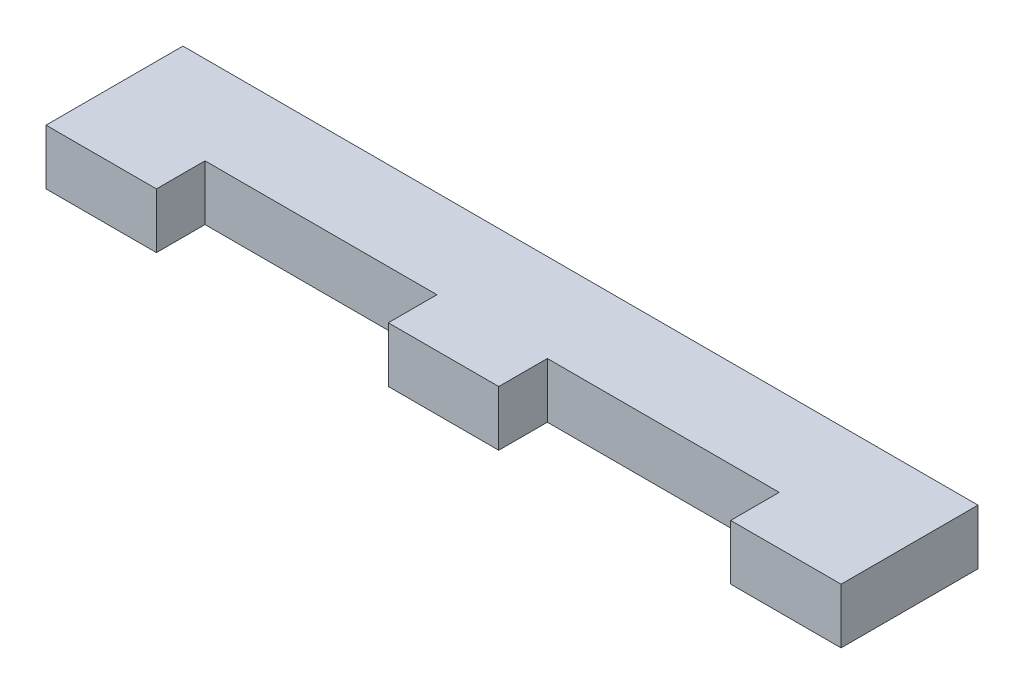
ISO-10303-21;
HEADER;
FILE_DESCRIPTION(('STEP AP214'),'2;1');
FILE_NAME('part.step','',(''),(''),'','','');
FILE_SCHEMA(('AUTOMOTIVE_DESIGN { 1 0 10303 214 1 1 1 1 }'));
ENDSEC;
DATA;
#1=APPLICATION_CONTEXT('core data for automotive mechanical design processes');
#2=APPLICATION_PROTOCOL_DEFINITION('international standard','automotive_design',2000,#1);
#3=PRODUCT_CONTEXT('',#1,'mechanical');
#4=PRODUCT('Part','Part','',(#3));
#5=PRODUCT_RELATED_PRODUCT_CATEGORY('part','',(#4));
#6=PRODUCT_DEFINITION_FORMATION('','',#4);
#7=PRODUCT_DEFINITION_CONTEXT('part definition',#1,'design');
#8=PRODUCT_DEFINITION('design','',#6,#7);
#9=PRODUCT_DEFINITION_SHAPE('','',#8);
#10=(LENGTH_UNIT() NAMED_UNIT(*) SI_UNIT(.MILLI.,.METRE.));
#11=(NAMED_UNIT(*) PLANE_ANGLE_UNIT() SI_UNIT($,.RADIAN.));
#12=(NAMED_UNIT(*) SI_UNIT($,.STERADIAN.) SOLID_ANGLE_UNIT());
#13=UNCERTAINTY_MEASURE_WITH_UNIT(LENGTH_MEASURE(1.E-05),#10,'distance_accuracy_value','');
#14=(GEOMETRIC_REPRESENTATION_CONTEXT(3) GLOBAL_UNCERTAINTY_ASSIGNED_CONTEXT((#13)) GLOBAL_UNIT_ASSIGNED_CONTEXT((#10,
#11,#12)) REPRESENTATION_CONTEXT('',''));
#15=CARTESIAN_POINT('',(0.,0.,0.));
#16=DIRECTION('',(0.,0.,1.));
#17=DIRECTION('',(1.,0.,0.));
#18=AXIS2_PLACEMENT_3D('',#15,#16,#17);
#19=CARTESIAN_POINT('',(-45.72,6.35,-5.08));
#20=DIRECTION('',(0.,0.,1.));
#21=DIRECTION('',(1.,0.,0.));
#22=AXIS2_PLACEMENT_3D('',#19,#20,#21);
#23=PLANE('',#22);
#24=DIRECTION('',(-1.,0.,0.));
#25=VECTOR('',#24,1.);
#26=CARTESIAN_POINT('',(-45.72,0.,-5.08));
#27=LINE('',#26,#25);
#28=CARTESIAN_POINT('',(45.72,0.,-5.08));
#29=VERTEX_POINT('',#28);
#30=CARTESIAN_POINT('',(-45.72,0.,-5.08));
#31=VERTEX_POINT('',#30);
#32=EDGE_CURVE('E157',#29,#31,#27,.T.);
#33=ORIENTED_EDGE('',*,*,#32,.T.);
#34=DIRECTION('',(0.,-1.,0.));
#35=VECTOR('',#34,1.);
#36=CARTESIAN_POINT('',(-45.72,6.35,-5.08));
#37=LINE('',#36,#35);
#38=CARTESIAN_POINT('',(-45.72,6.35,-5.08));
#39=VERTEX_POINT('',#38);
#40=EDGE_CURVE('E41',#39,#31,#37,.T.);
#41=ORIENTED_EDGE('',*,*,#40,.F.);
#42=DIRECTION('',(-1.,0.,0.));
#43=VECTOR('',#42,1.);
#44=CARTESIAN_POINT('',(-45.72,6.35,-5.08));
#45=LINE('',#44,#43);
#46=CARTESIAN_POINT('',(45.72,6.35,-5.08));
#47=VERTEX_POINT('',#46);
#48=EDGE_CURVE('E105',#47,#39,#45,.T.);
#49=ORIENTED_EDGE('',*,*,#48,.F.);
#50=DIRECTION('',(0.,-1.,0.));
#51=VECTOR('',#50,1.);
#52=CARTESIAN_POINT('',(45.72,6.35,-5.08));
#53=LINE('',#52,#51);
#54=EDGE_CURVE('E11',#47,#29,#53,.T.);
#55=ORIENTED_EDGE('',*,*,#54,.T.);
#56=EDGE_LOOP('',(#33,#41,#49,#55));
#57=FACE_BOUND('',#56,.T.);
#58=ADVANCED_FACE('F33',(#57),#23,.F.);
#59=CARTESIAN_POINT('',(-45.72,6.35,5.08));
#60=DIRECTION('',(1.,0.,0.));
#61=DIRECTION('',(0.,0.,-1.));
#62=AXIS2_PLACEMENT_3D('',#59,#60,#61);
#63=PLANE('',#62);
#64=DIRECTION('',(0.,0.,1.));
#65=VECTOR('',#64,1.);
#66=CARTESIAN_POINT('',(-45.72,0.,5.08));
#67=LINE('',#66,#65);
#68=CARTESIAN_POINT('',(-45.72,0.,10.668));
#69=VERTEX_POINT('',#68);
#70=EDGE_CURVE('E160',#31,#69,#67,.T.);
#71=ORIENTED_EDGE('',*,*,#70,.T.);
#72=DIRECTION('',(0.,-1.,0.));
#73=VECTOR('',#72,1.);
#74=CARTESIAN_POINT('',(-45.72,6.35,10.668));
#75=LINE('',#74,#73);
#76=CARTESIAN_POINT('',(-45.72,6.35,10.668));
#77=VERTEX_POINT('',#76);
#78=EDGE_CURVE('E197',#77,#69,#75,.T.);
#79=ORIENTED_EDGE('',*,*,#78,.F.);
#80=DIRECTION('',(0.,0.,1.));
#81=VECTOR('',#80,1.);
#82=CARTESIAN_POINT('',(-45.72,6.35,5.08));
#83=LINE('',#82,#81);
#84=EDGE_CURVE('E204',#39,#77,#83,.T.);
#85=ORIENTED_EDGE('',*,*,#84,.F.);
#86=ORIENTED_EDGE('',*,*,#40,.T.);
#87=EDGE_LOOP('',(#71,#79,#85,#86));
#88=FACE_BOUND('',#87,.T.);
#89=ADVANCED_FACE('F202',(#88),#63,.F.);
#90=CARTESIAN_POINT('',(-45.72,6.35,10.668));
#91=DIRECTION('',(0.,0.,-1.));
#92=DIRECTION('',(-1.,0.,0.));
#93=AXIS2_PLACEMENT_3D('',#90,#91,#92);
#94=PLANE('',#93);
#95=DIRECTION('',(1.,0.,0.));
#96=VECTOR('',#95,1.);
#97=CARTESIAN_POINT('',(-45.72,0.,10.668));
#98=LINE('',#97,#96);
#99=CARTESIAN_POINT('',(-33.02,0.,10.668));
#100=VERTEX_POINT('',#99);
#101=EDGE_CURVE('E162',#69,#100,#98,.T.);
#102=ORIENTED_EDGE('',*,*,#101,.T.);
#103=DIRECTION('',(0.,-1.,0.));
#104=VECTOR('',#103,1.);
#105=CARTESIAN_POINT('',(-33.02,6.35,10.668));
#106=LINE('',#105,#104);
#107=CARTESIAN_POINT('',(-33.02,6.35,10.668));
#108=VERTEX_POINT('',#107);
#109=EDGE_CURVE('E194',#108,#100,#106,.T.);
#110=ORIENTED_EDGE('',*,*,#109,.F.);
#111=DIRECTION('',(1.,0.,0.));
#112=VECTOR('',#111,1.);
#113=CARTESIAN_POINT('',(-45.72,6.35,10.668));
#114=LINE('',#113,#112);
#115=EDGE_CURVE('E223',#77,#108,#114,.T.);
#116=ORIENTED_EDGE('',*,*,#115,.F.);
#117=ORIENTED_EDGE('',*,*,#78,.T.);
#118=EDGE_LOOP('',(#102,#110,#116,#117));
#119=FACE_BOUND('',#118,.T.);
#120=ADVANCED_FACE('F214',(#119),#94,.F.);
#121=CARTESIAN_POINT('',(-33.02,6.35,5.08));
#122=DIRECTION('',(-1.,0.,0.));
#123=DIRECTION('',(0.,0.,1.));
#124=AXIS2_PLACEMENT_3D('',#121,#122,#123);
#125=PLANE('',#124);
#126=DIRECTION('',(0.,0.,-1.));
#127=VECTOR('',#126,1.);
#128=CARTESIAN_POINT('',(-33.02,0.,5.08));
#129=LINE('',#128,#127);
#130=CARTESIAN_POINT('',(-33.02,0.,5.08));
#131=VERTEX_POINT('',#130);
#132=EDGE_CURVE('E164',#100,#131,#129,.T.);
#133=ORIENTED_EDGE('',*,*,#132,.T.);
#134=DIRECTION('',(0.,-1.,0.));
#135=VECTOR('',#134,1.);
#136=CARTESIAN_POINT('',(-33.02,6.35,5.08));
#137=LINE('',#136,#135);
#138=CARTESIAN_POINT('',(-33.02,6.35,5.08));
#139=VERTEX_POINT('',#138);
#140=EDGE_CURVE('E191',#139,#131,#137,.T.);
#141=ORIENTED_EDGE('',*,*,#140,.F.);
#142=DIRECTION('',(0.,0.,-1.));
#143=VECTOR('',#142,1.);
#144=CARTESIAN_POINT('',(-33.02,6.35,5.08));
#145=LINE('',#144,#143);
#146=EDGE_CURVE('E220',#108,#139,#145,.T.);
#147=ORIENTED_EDGE('',*,*,#146,.F.);
#148=ORIENTED_EDGE('',*,*,#109,.T.);
#149=EDGE_LOOP('',(#133,#141,#147,#148));
#150=FACE_BOUND('',#149,.T.);
#151=ADVANCED_FACE('F218',(#150),#125,.F.);
#152=CARTESIAN_POINT('',(-33.02,6.35,5.08));
#153=DIRECTION('',(0.,0.,-1.));
#154=DIRECTION('',(-1.,0.,0.));
#155=AXIS2_PLACEMENT_3D('',#152,#153,#154);
#156=PLANE('',#155);
#157=DIRECTION('',(1.,0.,0.));
#158=VECTOR('',#157,1.);
#159=CARTESIAN_POINT('',(-33.02,0.,5.08));
#160=LINE('',#159,#158);
#161=CARTESIAN_POINT('',(-6.35,0.,5.08));
#162=VERTEX_POINT('',#161);
#163=EDGE_CURVE('E166',#131,#162,#160,.T.);
#164=ORIENTED_EDGE('',*,*,#163,.T.);
#165=DIRECTION('',(0.,-1.,0.));
#166=VECTOR('',#165,1.);
#167=CARTESIAN_POINT('',(-6.35,6.35,5.08));
#168=LINE('',#167,#166);
#169=CARTESIAN_POINT('',(-6.35,6.35,5.08));
#170=VERTEX_POINT('',#169);
#171=EDGE_CURVE('E188',#170,#162,#168,.T.);
#172=ORIENTED_EDGE('',*,*,#171,.F.);
#173=DIRECTION('',(1.,0.,0.));
#174=VECTOR('',#173,1.);
#175=CARTESIAN_POINT('',(-33.02,6.35,5.08));
#176=LINE('',#175,#174);
#177=EDGE_CURVE('E222',#139,#170,#176,.T.);
#178=ORIENTED_EDGE('',*,*,#177,.F.);
#179=ORIENTED_EDGE('',*,*,#140,.T.);
#180=EDGE_LOOP('',(#164,#172,#178,#179));
#181=FACE_BOUND('',#180,.T.);
#182=ADVANCED_FACE('F247',(#181),#156,.F.);
#183=CARTESIAN_POINT('',(-6.35,6.35,5.08));
#184=DIRECTION('',(1.,0.,0.));
#185=DIRECTION('',(0.,0.,-1.));
#186=AXIS2_PLACEMENT_3D('',#183,#184,#185);
#187=PLANE('',#186);
#188=DIRECTION('',(0.,0.,1.));
#189=VECTOR('',#188,1.);
#190=CARTESIAN_POINT('',(-6.35,0.,5.08));
#191=LINE('',#190,#189);
#192=CARTESIAN_POINT('',(-6.35,0.,10.668));
#193=VERTEX_POINT('',#192);
#194=EDGE_CURVE('E168',#162,#193,#191,.T.);
#195=ORIENTED_EDGE('',*,*,#194,.T.);
#196=DIRECTION('',(0.,-1.,0.));
#197=VECTOR('',#196,1.);
#198=CARTESIAN_POINT('',(-6.35,6.35,10.668));
#199=LINE('',#198,#197);
#200=CARTESIAN_POINT('',(-6.35,6.35,10.668));
#201=VERTEX_POINT('',#200);
#202=EDGE_CURVE('E185',#201,#193,#199,.T.);
#203=ORIENTED_EDGE('',*,*,#202,.F.);
#204=DIRECTION('',(0.,0.,1.));
#205=VECTOR('',#204,1.);
#206=CARTESIAN_POINT('',(-6.35,6.35,5.08));
#207=LINE('',#206,#205);
#208=EDGE_CURVE('E225',#170,#201,#207,.T.);
#209=ORIENTED_EDGE('',*,*,#208,.F.);
#210=ORIENTED_EDGE('',*,*,#171,.T.);
#211=EDGE_LOOP('',(#195,#203,#209,#210));
#212=FACE_BOUND('',#211,.T.);
#213=ADVANCED_FACE('F244',(#212),#187,.F.);
#214=CARTESIAN_POINT('',(-6.35,6.35,10.668));
#215=DIRECTION('',(0.,0.,-1.));
#216=DIRECTION('',(-1.,0.,0.));
#217=AXIS2_PLACEMENT_3D('',#214,#215,#216);
#218=PLANE('',#217);
#219=DIRECTION('',(1.,0.,0.));
#220=VECTOR('',#219,1.);
#221=CARTESIAN_POINT('',(-6.35,0.,10.668));
#222=LINE('',#221,#220);
#223=CARTESIAN_POINT('',(6.35,0.,10.668));
#224=VERTEX_POINT('',#223);
#225=EDGE_CURVE('E170',#193,#224,#222,.T.);
#226=ORIENTED_EDGE('',*,*,#225,.T.);
#227=DIRECTION('',(0.,-1.,0.));
#228=VECTOR('',#227,1.);
#229=CARTESIAN_POINT('',(6.35,6.35,10.668));
#230=LINE('',#229,#228);
#231=CARTESIAN_POINT('',(6.35,6.35,10.668));
#232=VERTEX_POINT('',#231);
#233=EDGE_CURVE('E182',#232,#224,#230,.T.);
#234=ORIENTED_EDGE('',*,*,#233,.F.);
#235=DIRECTION('',(1.,0.,0.));
#236=VECTOR('',#235,1.);
#237=CARTESIAN_POINT('',(-6.35,6.35,10.668));
#238=LINE('',#237,#236);
#239=EDGE_CURVE('E231',#201,#232,#238,.T.);
#240=ORIENTED_EDGE('',*,*,#239,.F.);
#241=ORIENTED_EDGE('',*,*,#202,.T.);
#242=EDGE_LOOP('',(#226,#234,#240,#241));
#243=FACE_BOUND('',#242,.T.);
#244=ADVANCED_FACE('F237',(#243),#218,.F.);
#245=CARTESIAN_POINT('',(6.35,6.35,5.08));
#246=DIRECTION('',(-1.,0.,0.));
#247=DIRECTION('',(0.,0.,1.));
#248=AXIS2_PLACEMENT_3D('',#245,#246,#247);
#249=PLANE('',#248);
#250=DIRECTION('',(0.,0.,-1.));
#251=VECTOR('',#250,1.);
#252=CARTESIAN_POINT('',(6.35,0.,5.08));
#253=LINE('',#252,#251);
#254=CARTESIAN_POINT('',(6.35,0.,5.08));
#255=VERTEX_POINT('',#254);
#256=EDGE_CURVE('E172',#224,#255,#253,.T.);
#257=ORIENTED_EDGE('',*,*,#256,.T.);
#258=DIRECTION('',(0.,-1.,0.));
#259=VECTOR('',#258,1.);
#260=CARTESIAN_POINT('',(6.35,6.35,5.08));
#261=LINE('',#260,#259);
#262=CARTESIAN_POINT('',(6.35,6.35,5.08));
#263=VERTEX_POINT('',#262);
#264=EDGE_CURVE('E146',#263,#255,#261,.T.);
#265=ORIENTED_EDGE('',*,*,#264,.F.);
#266=DIRECTION('',(0.,0.,-1.));
#267=VECTOR('',#266,1.);
#268=CARTESIAN_POINT('',(6.35,6.35,5.08));
#269=LINE('',#268,#267);
#270=EDGE_CURVE('E137',#232,#263,#269,.T.);
#271=ORIENTED_EDGE('',*,*,#270,.F.);
#272=ORIENTED_EDGE('',*,*,#233,.T.);
#273=EDGE_LOOP('',(#257,#265,#271,#272));
#274=FACE_BOUND('',#273,.T.);
#275=ADVANCED_FACE('F241',(#274),#249,.F.);
#276=CARTESIAN_POINT('',(6.35,6.35,5.08));
#277=DIRECTION('',(0.,0.,-1.));
#278=DIRECTION('',(-1.,0.,0.));
#279=AXIS2_PLACEMENT_3D('',#276,#277,#278);
#280=PLANE('',#279);
#281=DIRECTION('',(1.,0.,0.));
#282=VECTOR('',#281,1.);
#283=CARTESIAN_POINT('',(6.35,0.,5.08));
#284=LINE('',#283,#282);
#285=CARTESIAN_POINT('',(33.02,0.,5.08));
#286=VERTEX_POINT('',#285);
#287=EDGE_CURVE('E145',#255,#286,#284,.T.);
#288=ORIENTED_EDGE('',*,*,#287,.T.);
#289=DIRECTION('',(0.,-1.,0.));
#290=VECTOR('',#289,1.);
#291=CARTESIAN_POINT('',(33.02,6.35,5.08));
#292=LINE('',#291,#290);
#293=CARTESIAN_POINT('',(33.02,6.35,5.08));
#294=VERTEX_POINT('',#293);
#295=EDGE_CURVE('E142',#294,#286,#292,.T.);
#296=ORIENTED_EDGE('',*,*,#295,.F.);
#297=DIRECTION('',(1.,0.,0.));
#298=VECTOR('',#297,1.);
#299=CARTESIAN_POINT('',(6.35,6.35,5.08));
#300=LINE('',#299,#298);
#301=EDGE_CURVE('E131',#263,#294,#300,.T.);
#302=ORIENTED_EDGE('',*,*,#301,.F.);
#303=ORIENTED_EDGE('',*,*,#264,.T.);
#304=EDGE_LOOP('',(#288,#296,#302,#303));
#305=FACE_BOUND('',#304,.T.);
#306=ADVANCED_FACE('F143',(#305),#280,.F.);
#307=CARTESIAN_POINT('',(33.02,6.35,5.08));
#308=DIRECTION('',(1.,0.,0.));
#309=DIRECTION('',(0.,0.,-1.));
#310=AXIS2_PLACEMENT_3D('',#307,#308,#309);
#311=PLANE('',#310);
#312=DIRECTION('',(0.,0.,1.));
#313=VECTOR('',#312,1.);
#314=CARTESIAN_POINT('',(33.02,0.,5.08));
#315=LINE('',#314,#313);
#316=CARTESIAN_POINT('',(33.02,0.,10.668));
#317=VERTEX_POINT('',#316);
#318=EDGE_CURVE('E91',#286,#317,#315,.T.);
#319=ORIENTED_EDGE('',*,*,#318,.T.);
#320=DIRECTION('',(0.,-1.,0.));
#321=VECTOR('',#320,1.);
#322=CARTESIAN_POINT('',(33.02,6.35,10.668));
#323=LINE('',#322,#321);
#324=CARTESIAN_POINT('',(33.02,6.35,10.668));
#325=VERTEX_POINT('',#324);
#326=EDGE_CURVE('E147',#325,#317,#323,.T.);
#327=ORIENTED_EDGE('',*,*,#326,.F.);
#328=DIRECTION('',(0.,0.,1.));
#329=VECTOR('',#328,1.);
#330=CARTESIAN_POINT('',(33.02,6.35,5.08));
#331=LINE('',#330,#329);
#332=EDGE_CURVE('E135',#294,#325,#331,.T.);
#333=ORIENTED_EDGE('',*,*,#332,.F.);
#334=ORIENTED_EDGE('',*,*,#295,.T.);
#335=EDGE_LOOP('',(#319,#327,#333,#334));
#336=FACE_BOUND('',#335,.T.);
#337=ADVANCED_FACE('F149',(#336),#311,.F.);
#338=CARTESIAN_POINT('',(33.02,6.35,10.668));
#339=DIRECTION('',(0.,0.,-1.));
#340=DIRECTION('',(-1.,0.,0.));
#341=AXIS2_PLACEMENT_3D('',#338,#339,#340);
#342=PLANE('',#341);
#343=DIRECTION('',(1.,0.,0.));
#344=VECTOR('',#343,1.);
#345=CARTESIAN_POINT('',(33.02,0.,10.668));
#346=LINE('',#345,#344);
#347=CARTESIAN_POINT('',(45.72,0.,10.668));
#348=VERTEX_POINT('',#347);
#349=EDGE_CURVE('E98',#317,#348,#346,.T.);
#350=ORIENTED_EDGE('',*,*,#349,.T.);
#351=DIRECTION('',(0.,-1.,0.));
#352=VECTOR('',#351,1.);
#353=CARTESIAN_POINT('',(45.72,6.35,10.668));
#354=LINE('',#353,#352);
#355=CARTESIAN_POINT('',(45.72,6.35,10.668));
#356=VERTEX_POINT('',#355);
#357=EDGE_CURVE('E153',#356,#348,#354,.T.);
#358=ORIENTED_EDGE('',*,*,#357,.F.);
#359=DIRECTION('',(1.,0.,0.));
#360=VECTOR('',#359,1.);
#361=CARTESIAN_POINT('',(33.02,6.35,10.668));
#362=LINE('',#361,#360);
#363=EDGE_CURVE('E151',#325,#356,#362,.T.);
#364=ORIENTED_EDGE('',*,*,#363,.F.);
#365=ORIENTED_EDGE('',*,*,#326,.T.);
#366=EDGE_LOOP('',(#350,#358,#364,#365));
#367=FACE_BOUND('',#366,.T.);
#368=ADVANCED_FACE('F313',(#367),#342,.F.);
#369=CARTESIAN_POINT('',(45.72,6.35,5.08));
#370=DIRECTION('',(-1.,0.,0.));
#371=DIRECTION('',(0.,0.,1.));
#372=AXIS2_PLACEMENT_3D('',#369,#370,#371);
#373=PLANE('',#372);
#374=DIRECTION('',(0.,0.,-1.));
#375=VECTOR('',#374,1.);
#376=CARTESIAN_POINT('',(45.72,0.,5.08));
#377=LINE('',#376,#375);
#378=EDGE_CURVE('E177',#348,#29,#377,.T.);
#379=ORIENTED_EDGE('',*,*,#378,.T.);
#380=ORIENTED_EDGE('',*,*,#54,.F.);
#381=DIRECTION('',(0.,0.,-1.));
#382=VECTOR('',#381,1.);
#383=CARTESIAN_POINT('',(45.72,6.35,5.08));
#384=LINE('',#383,#382);
#385=EDGE_CURVE('E49',#356,#47,#384,.T.);
#386=ORIENTED_EDGE('',*,*,#385,.F.);
#387=ORIENTED_EDGE('',*,*,#357,.T.);
#388=EDGE_LOOP('',(#379,#380,#386,#387));
#389=FACE_BOUND('',#388,.T.);
#390=ADVANCED_FACE('F322',(#389),#373,.F.);
#391=CARTESIAN_POINT('',(0.,6.35,0.));
#392=DIRECTION('',(0.,-1.,0.));
#393=DIRECTION('',(0.,0.,-1.));
#394=AXIS2_PLACEMENT_3D('',#391,#392,#393);
#395=PLANE('',#394);
#396=ORIENTED_EDGE('',*,*,#385,.T.);
#397=ORIENTED_EDGE('',*,*,#48,.T.);
#398=ORIENTED_EDGE('',*,*,#84,.T.);
#399=ORIENTED_EDGE('',*,*,#115,.T.);
#400=ORIENTED_EDGE('',*,*,#146,.T.);
#401=ORIENTED_EDGE('',*,*,#177,.T.);
#402=ORIENTED_EDGE('',*,*,#208,.T.);
#403=ORIENTED_EDGE('',*,*,#239,.T.);
#404=ORIENTED_EDGE('',*,*,#270,.T.);
#405=ORIENTED_EDGE('',*,*,#301,.T.);
#406=ORIENTED_EDGE('',*,*,#332,.T.);
#407=ORIENTED_EDGE('',*,*,#363,.T.);
#408=EDGE_LOOP('',(#396,#397,#398,#399,#400,#401,#402,#403,#404,#405,#406,#407));
#409=FACE_BOUND('',#408,.T.);
#410=ADVANCED_FACE('F133',(#409),#395,.F.);
#411=CARTESIAN_POINT('',(0.,0.,0.));
#412=DIRECTION('',(0.,-1.,0.));
#413=DIRECTION('',(0.,0.,-1.));
#414=AXIS2_PLACEMENT_3D('',#411,#412,#413);
#415=PLANE('',#414);
#416=ORIENTED_EDGE('',*,*,#32,.F.);
#417=ORIENTED_EDGE('',*,*,#378,.F.);
#418=ORIENTED_EDGE('',*,*,#349,.F.);
#419=ORIENTED_EDGE('',*,*,#318,.F.);
#420=ORIENTED_EDGE('',*,*,#287,.F.);
#421=ORIENTED_EDGE('',*,*,#256,.F.);
#422=ORIENTED_EDGE('',*,*,#225,.F.);
#423=ORIENTED_EDGE('',*,*,#194,.F.);
#424=ORIENTED_EDGE('',*,*,#163,.F.);
#425=ORIENTED_EDGE('',*,*,#132,.F.);
#426=ORIENTED_EDGE('',*,*,#101,.F.);
#427=ORIENTED_EDGE('',*,*,#70,.F.);
#428=EDGE_LOOP('',(#416,#417,#418,#419,#420,#421,#422,#423,#424,#425,#426,#427));
#429=FACE_BOUND('',#428,.T.);
#430=ADVANCED_FACE('F208',(#429),#415,.T.);
#431=CLOSED_SHELL('',(#58,#89,#120,#151,#182,#213,#244,#275,#306,#337,#368,#390,#410,#430));
#432=MANIFOLD_SOLID_BREP('B2',#431);
#433=ADVANCED_BREP_SHAPE_REPRESENTATION('',(#18,#432),#14);
#434=SHAPE_DEFINITION_REPRESENTATION(#9,#433);
ENDSEC;
END-ISO-10303-21;
